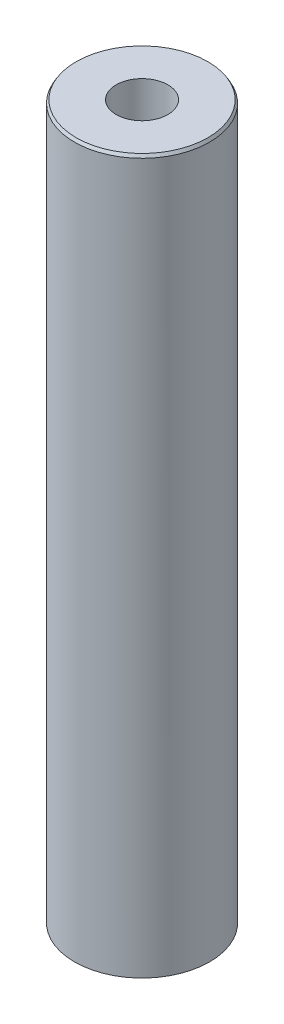
ISO-10303-21;
HEADER;
FILE_DESCRIPTION(('STEP AP214'),'2;1');
FILE_NAME('part.step','',(''),(''),'','','');
FILE_SCHEMA(('AUTOMOTIVE_DESIGN { 1 0 10303 214 1 1 1 1 }'));
ENDSEC;
DATA;
#1=APPLICATION_CONTEXT('core data for automotive mechanical design processes');
#2=APPLICATION_PROTOCOL_DEFINITION('international standard','automotive_design',2000,#1);
#3=PRODUCT_CONTEXT('',#1,'mechanical');
#4=PRODUCT('Part','Part','',(#3));
#5=PRODUCT_RELATED_PRODUCT_CATEGORY('part','',(#4));
#6=PRODUCT_DEFINITION_FORMATION('','',#4);
#7=PRODUCT_DEFINITION_CONTEXT('part definition',#1,'design');
#8=PRODUCT_DEFINITION('design','',#6,#7);
#9=PRODUCT_DEFINITION_SHAPE('','',#8);
#10=(LENGTH_UNIT() NAMED_UNIT(*) SI_UNIT(.MILLI.,.METRE.));
#11=(NAMED_UNIT(*) PLANE_ANGLE_UNIT() SI_UNIT($,.RADIAN.));
#12=(NAMED_UNIT(*) SI_UNIT($,.STERADIAN.) SOLID_ANGLE_UNIT());
#13=UNCERTAINTY_MEASURE_WITH_UNIT(LENGTH_MEASURE(1.E-05),#10,'distance_accuracy_value','');
#14=(GEOMETRIC_REPRESENTATION_CONTEXT(3) GLOBAL_UNCERTAINTY_ASSIGNED_CONTEXT((#13)) GLOBAL_UNIT_ASSIGNED_CONTEXT((#10,
#11,#12)) REPRESENTATION_CONTEXT('',''));
#15=CARTESIAN_POINT('',(0.,0.,0.));
#16=DIRECTION('',(0.,0.,1.));
#17=DIRECTION('',(1.,0.,0.));
#18=AXIS2_PLACEMENT_3D('',#15,#16,#17);
#19=CARTESIAN_POINT('',(0.,185.014718534312,0.));
#20=DIRECTION('',(0.,-1.,0.));
#21=DIRECTION('',(0.,0.,-1.));
#22=AXIS2_PLACEMENT_3D('',#19,#20,#21);
#23=CYLINDRICAL_SURFACE('',#22,17.5);
#24=CARTESIAN_POINT('',(0.,184.24386998606,0.));
#25=DIRECTION('',(0.,1.,0.));
#26=DIRECTION('',(0.,0.,1.));
#27=AXIS2_PLACEMENT_3D('',#24,#25,#26);
#28=CIRCLE('',#27,17.5);
#29=CARTESIAN_POINT('',(0.,184.24386998606,-17.5));
#30=VERTEX_POINT('',#29);
#31=EDGE_CURVE('E50',#30,#30,#28,.F.);
#32=CARTESIAN_POINT('',(0.,0.445049616837695,0.));
#33=DIRECTION('',(0.,1.,0.));
#34=DIRECTION('',(0.,0.,1.));
#35=AXIS2_PLACEMENT_3D('',#32,#33,#34);
#36=CIRCLE('',#35,17.5);
#37=CARTESIAN_POINT('',(0.,0.445049616837695,-17.5));
#38=VERTEX_POINT('',#37);
#39=EDGE_CURVE('E51',#38,#38,#36,.T.);
#40=CARTESIAN_POINT('',(0.,184.24386998606,-17.5));
#41=CARTESIAN_POINT('',(0.,182.329298940548,-17.5));
#42=CARTESIAN_POINT('',(0.,180.414727895035,-17.5));
#43=CARTESIAN_POINT('',(0.,176.585585804009,-17.5));
#44=CARTESIAN_POINT('',(0.,174.671014758497,-17.5));
#45=CARTESIAN_POINT('',(0.,170.841872667471,-17.5));
#46=CARTESIAN_POINT('',(0.,168.927301621958,-17.5));
#47=CARTESIAN_POINT('',(0.,165.098159530933,-17.5));
#48=CARTESIAN_POINT('',(0.,163.18358848542,-17.5));
#49=CARTESIAN_POINT('',(0.,159.354446394395,-17.5));
#50=CARTESIAN_POINT('',(0.,157.439875348882,-17.5));
#51=CARTESIAN_POINT('',(0.,153.610733257857,-17.5));
#52=CARTESIAN_POINT('',(0.,151.696162212344,-17.5));
#53=CARTESIAN_POINT('',(0.,147.867020121318,-17.5));
#54=CARTESIAN_POINT('',(0.,145.952449075806,-17.5));
#55=CARTESIAN_POINT('',(0.,142.12330698478,-17.5));
#56=CARTESIAN_POINT('',(0.,140.208735939267,-17.5));
#57=CARTESIAN_POINT('',(0.,136.379593848242,-17.5));
#58=CARTESIAN_POINT('',(0.,134.465022802729,-17.5));
#59=CARTESIAN_POINT('',(0.,130.635880711704,-17.5));
#60=CARTESIAN_POINT('',(0.,128.721309666191,-17.5));
#61=CARTESIAN_POINT('',(0.,124.892167575166,-17.5));
#62=CARTESIAN_POINT('',(0.,122.977596529653,-17.5));
#63=CARTESIAN_POINT('',(0.,119.148454438627,-17.5));
#64=CARTESIAN_POINT('',(0.,117.233883393115,-17.5));
#65=CARTESIAN_POINT('',(0.,113.404741302089,-17.5));
#66=CARTESIAN_POINT('',(0.,111.490170256576,-17.5));
#67=CARTESIAN_POINT('',(0.,107.661028165551,-17.5));
#68=CARTESIAN_POINT('',(0.,105.746457120038,-17.5));
#69=CARTESIAN_POINT('',(0.,101.917315029013,-17.5));
#70=CARTESIAN_POINT('',(0.,100.0027439835,-17.5));
#71=CARTESIAN_POINT('',(0.,96.1736018924745,-17.5));
#72=CARTESIAN_POINT('',(0.,94.2590308469617,-17.5));
#73=CARTESIAN_POINT('',(0.,90.4298887559363,-17.5));
#74=CARTESIAN_POINT('',(0.,88.5153177104235,-17.5));
#75=CARTESIAN_POINT('',(0.,84.6861756193981,-17.5));
#76=CARTESIAN_POINT('',(0.,82.7716045738853,-17.5));
#77=CARTESIAN_POINT('',(0.,78.9424624828599,-17.5));
#78=CARTESIAN_POINT('',(0.,77.0278914373471,-17.5));
#79=CARTESIAN_POINT('',(0.,73.1987493463216,-17.5));
#80=CARTESIAN_POINT('',(0.,71.2841783008089,-17.5));
#81=CARTESIAN_POINT('',(0.,67.4550362097834,-17.5));
#82=CARTESIAN_POINT('',(0.,65.5404651642707,-17.5));
#83=CARTESIAN_POINT('',(0.,61.7113230732452,-17.5));
#84=CARTESIAN_POINT('',(0.,59.7967520277325,-17.5));
#85=CARTESIAN_POINT('',(0.,55.967609936707,-17.5));
#86=CARTESIAN_POINT('',(0.,54.0530388911943,-17.5));
#87=CARTESIAN_POINT('',(0.,50.2238968001688,-17.5));
#88=CARTESIAN_POINT('',(0.,48.3093257546561,-17.5));
#89=CARTESIAN_POINT('',(0.,44.4801836636306,-17.5));
#90=CARTESIAN_POINT('',(0.,42.5656126181179,-17.5));
#91=CARTESIAN_POINT('',(0.,38.7364705270924,-17.5));
#92=CARTESIAN_POINT('',(0.,36.8218994815797,-17.5));
#93=CARTESIAN_POINT('',(0.,32.9927573905542,-17.5));
#94=CARTESIAN_POINT('',(0.,31.0781863450415,-17.5));
#95=CARTESIAN_POINT('',(0.,27.249044254016,-17.5));
#96=CARTESIAN_POINT('',(0.,25.3344732085033,-17.5));
#97=CARTESIAN_POINT('',(0.,21.5053311174778,-17.5));
#98=CARTESIAN_POINT('',(0.,19.5907600719651,-17.5));
#99=CARTESIAN_POINT('',(0.,15.7616179809396,-17.5));
#100=CARTESIAN_POINT('',(0.,13.8470469354268,-17.5));
#101=CARTESIAN_POINT('',(0.,10.0179048444014,-17.5));
#102=CARTESIAN_POINT('',(0.,8.10333379888864,-17.5));
#103=CARTESIAN_POINT('',(0.,4.27419170786317,-17.5));
#104=CARTESIAN_POINT('',(0.,2.35962066235043,-17.5));
#105=CARTESIAN_POINT('',(0.,0.445049616837695,-17.5));
#106=B_SPLINE_CURVE_WITH_KNOTS('',3,(#40,#41,#42,#43,#44,#45,#46,#47,#48,#49,#50,#51,#52,#53,
#54,#55,#56,#57,#58,#59,#60,#61,#62,#63,#64,#65,#66,#67,#68,#69,#70,#71,#72,#73,#74,#75,#76,#77,
#78,#79,#80,#81,#82,#83,#84,#85,#86,#87,#88,#89,#90,#91,#92,#93,#94,#95,#96,#97,#98,#99,#100,
#101,#102,#103,#104,#105),.UNSPECIFIED.,.F.,.F.,(4,2,2,2,2,2,2,2,2,2,2,2,2,2,2,2,2,2,2,2,2,2,2,
2,2,2,2,2,2,2,2,2,4),(0.,5.74371313653821,11.4874262730764,17.2311394096146,22.9748525461528,
28.718565682691,34.4622788192293,40.2059919557675,45.9497050923057,51.6934182288439,
57.4371313653821,63.1808445019203,68.9245576384585,74.6682707749967,80.4119839115349,
86.1556970480731,91.8994101846113,97.6431233211495,103.386836457688,109.130549594226,
114.874262730764,120.617975867302,126.361689003841,132.105402140379,137.849115276917,
143.592828413455,149.336541549993,155.080254686532,160.82396782307,166.567680959608,
172.311394096146,178.055107232684,183.798820369223),.UNSPECIFIED.);
#107=EDGE_CURVE('BSEAM39',#30,#38,#106,.T.);
#108=ORIENTED_EDGE('',*,*,#31,.T.);
#109=ORIENTED_EDGE('',*,*,#39,.T.);
#110=ORIENTED_EDGE('',*,*,#107,.T.);
#111=ORIENTED_EDGE('',*,*,#107,.F.);
#112=EDGE_LOOP('',(#108,#110,#109,#111));
#113=FACE_BOUND('',#112,.T.);
#114=ADVANCED_FACE('F39',(#113),#23,.T.);
#115=CARTESIAN_POINT('',(0.,185.014718534312,0.));
#116=DIRECTION('',(0.,1.,0.));
#117=DIRECTION('',(0.,0.,1.));
#118=AXIS2_PLACEMENT_3D('',#115,#116,#117);
#119=PLANE('',#118);
#120=CARTESIAN_POINT('',(0.,185.014718534312,0.));
#121=DIRECTION('',(0.,1.,0.));
#122=DIRECTION('',(0.,0.,1.));
#123=AXIS2_PLACEMENT_3D('',#120,#121,#122);
#124=CIRCLE('',#123,17.0549503831625);
#125=CARTESIAN_POINT('',(0.,185.014718534312,17.0549503831625));
#126=VERTEX_POINT('',#125);
#127=EDGE_CURVE('E54',#126,#126,#124,.T.);
#128=ORIENTED_EDGE('',*,*,#127,.T.);
#129=EDGE_LOOP('',(#128));
#130=FACE_BOUND('',#129,.T.);
#131=CARTESIAN_POINT('',(0.,185.014718534312,0.));
#132=DIRECTION('',(0.,1.,0.));
#133=DIRECTION('',(0.,0.,1.));
#134=AXIS2_PLACEMENT_3D('',#131,#132,#133);
#135=CIRCLE('',#134,6.69008347781287);
#136=CARTESIAN_POINT('',(0.,185.014718534312,-6.69008347781287));
#137=VERTEX_POINT('',#136);
#138=EDGE_CURVE('E58',#137,#137,#135,.T.);
#139=ORIENTED_EDGE('',*,*,#138,.F.);
#140=EDGE_LOOP('',(#139));
#141=FACE_BOUND('',#140,.T.);
#142=ADVANCED_FACE('F69',(#130,#141),#119,.T.);
#143=CARTESIAN_POINT('',(0.,0.,0.));
#144=DIRECTION('',(0.,1.,0.));
#145=DIRECTION('',(0.,0.,1.));
#146=AXIS2_PLACEMENT_3D('',#143,#144,#145);
#147=PLANE('',#146);
#148=CARTESIAN_POINT('',(0.,0.,0.));
#149=DIRECTION('',(0.,1.,0.));
#150=DIRECTION('',(0.,0.,1.));
#151=AXIS2_PLACEMENT_3D('',#148,#149,#150);
#152=CIRCLE('',#151,16.729151451748);
#153=CARTESIAN_POINT('',(0.,0.,16.729151451748));
#154=VERTEX_POINT('',#153);
#155=EDGE_CURVE('E10',#154,#154,#152,.F.);
#156=ORIENTED_EDGE('',*,*,#155,.T.);
#157=EDGE_LOOP('',(#156));
#158=FACE_BOUND('',#157,.T.);
#159=CARTESIAN_POINT('',(0.,0.,0.));
#160=DIRECTION('',(0.,1.,0.));
#161=DIRECTION('',(0.,0.,1.));
#162=AXIS2_PLACEMENT_3D('',#159,#160,#161);
#163=CIRCLE('',#162,6.69008347781287);
#164=CARTESIAN_POINT('',(0.,0.,-6.69008347781287));
#165=VERTEX_POINT('',#164);
#166=EDGE_CURVE('E63',#165,#165,#163,.T.);
#167=ORIENTED_EDGE('',*,*,#166,.T.);
#168=EDGE_LOOP('',(#167));
#169=FACE_BOUND('',#168,.T.);
#170=ADVANCED_FACE('F75',(#158,#169),#147,.F.);
#171=CARTESIAN_POINT('',(0.,185.014718534312,0.));
#172=DIRECTION('',(0.,-1.,0.));
#173=DIRECTION('',(0.,0.,-1.));
#174=AXIS2_PLACEMENT_3D('',#171,#172,#173);
#175=CYLINDRICAL_SURFACE('',#174,6.69008347781287);
#176=CARTESIAN_POINT('',(0.,185.014718534312,-6.69008347781287));
#177=CARTESIAN_POINT('',(0.,183.087481882913,-6.69008347781287));
#178=CARTESIAN_POINT('',(0.,181.160245231514,-6.69008347781287));
#179=CARTESIAN_POINT('',(0.,177.305771928716,-6.69008347781287));
#180=CARTESIAN_POINT('',(0.,175.378535277317,-6.69008347781287));
#181=CARTESIAN_POINT('',(0.,171.524061974518,-6.69008347781287));
#182=CARTESIAN_POINT('',(0.,169.596825323119,-6.69008347781287));
#183=CARTESIAN_POINT('',(0.,165.742352020321,-6.69008347781287));
#184=CARTESIAN_POINT('',(0.,163.815115368922,-6.69008347781287));
#185=CARTESIAN_POINT('',(0.,159.960642066124,-6.69008347781287));
#186=CARTESIAN_POINT('',(0.,158.033405414725,-6.69008347781287));
#187=CARTESIAN_POINT('',(0.,154.178932111927,-6.69008347781287));
#188=CARTESIAN_POINT('',(0.,152.251695460528,-6.69008347781287));
#189=CARTESIAN_POINT('',(0.,148.397222157729,-6.69008347781287));
#190=CARTESIAN_POINT('',(0.,146.46998550633,-6.69008347781287));
#191=CARTESIAN_POINT('',(0.,142.615512203532,-6.69008347781287));
#192=CARTESIAN_POINT('',(0.,140.688275552133,-6.69008347781287));
#193=CARTESIAN_POINT('',(0.,136.833802249335,-6.69008347781287));
#194=CARTESIAN_POINT('',(0.,134.906565597936,-6.69008347781287));
#195=CARTESIAN_POINT('',(0.,131.052092295138,-6.69008347781287));
#196=CARTESIAN_POINT('',(0.,129.124855643739,-6.69008347781287));
#197=CARTESIAN_POINT('',(0.,125.27038234094,-6.69008347781287));
#198=CARTESIAN_POINT('',(0.,123.343145689541,-6.69008347781287));
#199=CARTESIAN_POINT('',(0.,119.488672386743,-6.69008347781287));
#200=CARTESIAN_POINT('',(0.,117.561435735344,-6.69008347781287));
#201=CARTESIAN_POINT('',(0.,113.706962432546,-6.69008347781287));
#202=CARTESIAN_POINT('',(0.,111.779725781147,-6.69008347781287));
#203=CARTESIAN_POINT('',(0.,107.925252478349,-6.69008347781287));
#204=CARTESIAN_POINT('',(0.,105.99801582695,-6.69008347781287));
#205=CARTESIAN_POINT('',(0.,102.143542524151,-6.69008347781287));
#206=CARTESIAN_POINT('',(0.,100.216305872752,-6.69008347781287));
#207=CARTESIAN_POINT('',(0.,96.3618325699541,-6.69008347781287));
#208=CARTESIAN_POINT('',(0.,94.434595918555,-6.69008347781287));
#209=CARTESIAN_POINT('',(0.,90.5801226157569,-6.69008347781287));
#210=CARTESIAN_POINT('',(0.,88.6528859643578,-6.69008347781287));
#211=CARTESIAN_POINT('',(0.,84.7984126615596,-6.69008347781287));
#212=CARTESIAN_POINT('',(0.,82.8711760101605,-6.69008347781287));
#213=CARTESIAN_POINT('',(0.,79.0167027073624,-6.69008347781287));
#214=CARTESIAN_POINT('',(0.,77.0894660559633,-6.69008347781287));
#215=CARTESIAN_POINT('',(0.,73.2349927531651,-6.69008347781287));
#216=CARTESIAN_POINT('',(0.,71.3077561017661,-6.69008347781287));
#217=CARTESIAN_POINT('',(0.,67.4532827989679,-6.69008347781287));
#218=CARTESIAN_POINT('',(0.,65.5260461475688,-6.69008347781287));
#219=CARTESIAN_POINT('',(0.,61.6715728447706,-6.69008347781287));
#220=CARTESIAN_POINT('',(0.,59.7443361933716,-6.69008347781287));
#221=CARTESIAN_POINT('',(0.,55.8898628905734,-6.69008347781287));
#222=CARTESIAN_POINT('',(0.,53.9626262391743,-6.69008347781287));
#223=CARTESIAN_POINT('',(0.,50.1081529363761,-6.69008347781287));
#224=CARTESIAN_POINT('',(0.,48.180916284977,-6.69008347781287));
#225=CARTESIAN_POINT('',(0.,44.3264429821789,-6.69008347781287));
#226=CARTESIAN_POINT('',(0.,42.3992063307798,-6.69008347781287));
#227=CARTESIAN_POINT('',(0.,38.5447330279816,-6.69008347781287));
#228=CARTESIAN_POINT('',(0.,36.6174963765826,-6.69008347781287));
#229=CARTESIAN_POINT('',(0.,32.7630230737844,-6.69008347781287));
#230=CARTESIAN_POINT('',(0.,30.8357864223853,-6.69008347781287));
#231=CARTESIAN_POINT('',(0.,26.9813131195871,-6.69008347781287));
#232=CARTESIAN_POINT('',(0.,25.0540764681881,-6.69008347781287));
#233=CARTESIAN_POINT('',(0.,21.1996031653899,-6.69008347781287));
#234=CARTESIAN_POINT('',(0.,19.2723665139908,-6.69008347781287));
#235=CARTESIAN_POINT('',(0.,15.4178932111926,-6.69008347781287));
#236=CARTESIAN_POINT('',(0.,13.4906565597935,-6.69008347781287));
#237=CARTESIAN_POINT('',(0.,9.63618325699538,-6.69008347781287));
#238=CARTESIAN_POINT('',(0.,7.7089466055963,-6.69008347781287));
#239=CARTESIAN_POINT('',(0.,3.85447330279814,-6.69008347781287));
#240=CARTESIAN_POINT('',(0.,1.92723665139905,-6.69008347781287));
#241=CARTESIAN_POINT('',(0.,0.,-6.69008347781287));
#242=B_SPLINE_CURVE_WITH_KNOTS('',3,(#176,#177,#178,#179,#180,#181,#182,#183,#184,#185,#186,
#187,#188,#189,#190,#191,#192,#193,#194,#195,#196,#197,#198,#199,#200,#201,#202,#203,#204,#205,
#206,#207,#208,#209,#210,#211,#212,#213,#214,#215,#216,#217,#218,#219,#220,#221,#222,#223,#224,
#225,#226,#227,#228,#229,#230,#231,#232,#233,#234,#235,#236,#237,#238,#239,#240,#241),
.UNSPECIFIED.,.F.,.F.,(4,2,2,2,2,2,2,2,2,2,2,2,2,2,2,2,2,2,2,2,2,2,2,2,2,2,2,2,2,2,2,2,4),(0.,
5.78170995419724,11.5634199083945,17.3451298625917,23.126839816789,28.9085497709862,
34.6902597251835,40.4719696793807,46.253679633578,52.0353895877752,57.8170995419725,
63.5988094961697,69.380519450367,75.1622294045642,80.9439393587615,86.7256493129587,
92.507359267156,98.2890692213532,104.07077917555,109.852489129748,115.634199083945,
121.415909038142,127.197618992339,132.979328946537,138.761038900734,144.542748854931,
150.324458809128,156.106168763326,161.887878717523,167.66958867172,173.451298625917,
179.233008580115,185.014718534312),.UNSPECIFIED.);
#243=EDGE_CURVE('BSEAM70',#137,#165,#242,.T.);
#244=ORIENTED_EDGE('',*,*,#138,.T.);
#245=ORIENTED_EDGE('',*,*,#166,.F.);
#246=ORIENTED_EDGE('',*,*,#243,.T.);
#247=ORIENTED_EDGE('',*,*,#243,.F.);
#248=EDGE_LOOP('',(#244,#246,#245,#247));
#249=FACE_BOUND('',#248,.T.);
#250=ADVANCED_FACE('F70',(#249),#175,.F.);
#251=CARTESIAN_POINT('',(0.,185.014718534312,0.));
#252=DIRECTION('',(0.,-1.,0.));
#253=DIRECTION('',(0.,0.,-1.));
#254=AXIS2_PLACEMENT_3D('',#251,#252,#253);
#255=CONICAL_SURFACE('',#254,17.0549503831625,0.523598775598279);
#256=ORIENTED_EDGE('',*,*,#31,.F.);
#257=EDGE_LOOP('',(#256));
#258=FACE_BOUND('',#257,.T.);
#259=ORIENTED_EDGE('',*,*,#127,.F.);
#260=EDGE_LOOP('',(#259));
#261=FACE_BOUND('',#260,.T.);
#262=ADVANCED_FACE('F81',(#258,#261),#255,.T.);
#263=CARTESIAN_POINT('',(0.,0.445049616837695,0.));
#264=DIRECTION('',(0.,1.,0.));
#265=DIRECTION('',(0.,0.,1.));
#266=AXIS2_PLACEMENT_3D('',#263,#264,#265);
#267=CONICAL_SURFACE('',#266,17.5,1.04719755119661);
#268=ORIENTED_EDGE('',*,*,#155,.F.);
#269=EDGE_LOOP('',(#268));
#270=FACE_BOUND('',#269,.T.);
#271=ORIENTED_EDGE('',*,*,#39,.F.);
#272=EDGE_LOOP('',(#271));
#273=FACE_BOUND('',#272,.T.);
#274=ADVANCED_FACE('F45',(#270,#273),#267,.T.);
#275=CLOSED_SHELL('',(#114,#142,#170,#250,#262,#274));
#276=MANIFOLD_SOLID_BREP('B2',#275);
#277=ADVANCED_BREP_SHAPE_REPRESENTATION('',(#18,#276),#14);
#278=SHAPE_DEFINITION_REPRESENTATION(#9,#277);
ENDSEC;
END-ISO-10303-21;
